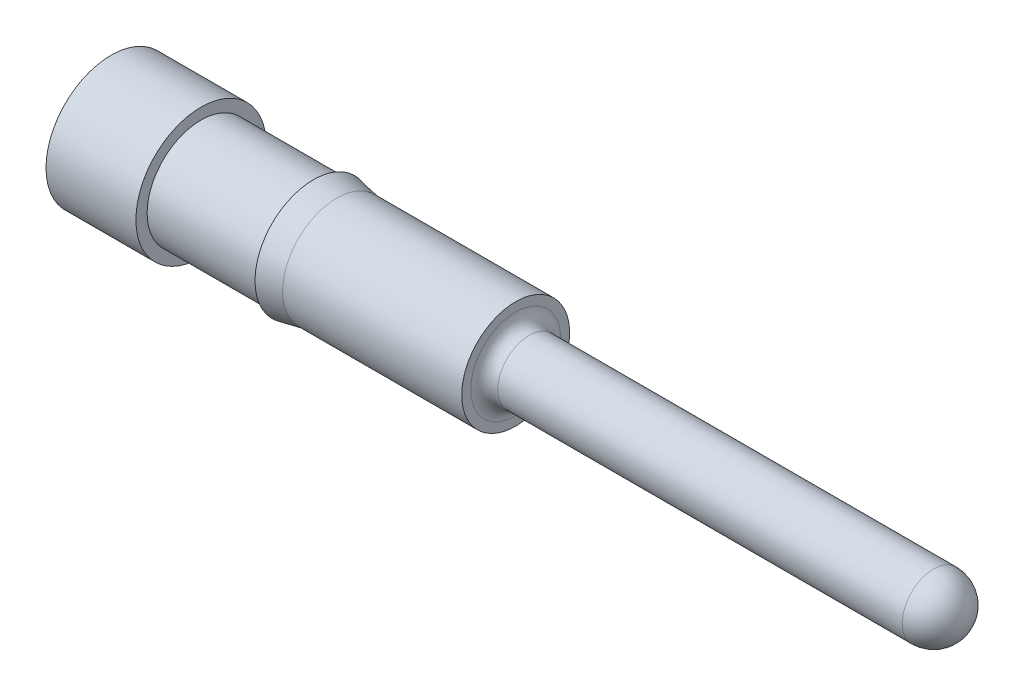
ISO-10303-21;
HEADER;
FILE_DESCRIPTION(('STEP AP214'),'2;1');
FILE_NAME('part.step','',(''),(''),'','','');
FILE_SCHEMA(('AUTOMOTIVE_DESIGN { 1 0 10303 214 1 1 1 1 }'));
ENDSEC;
DATA;
#1=APPLICATION_CONTEXT('core data for automotive mechanical design processes');
#2=APPLICATION_PROTOCOL_DEFINITION('international standard','automotive_design',2000,#1);
#3=PRODUCT_CONTEXT('',#1,'mechanical');
#4=PRODUCT('Part','Part','',(#3));
#5=PRODUCT_RELATED_PRODUCT_CATEGORY('part','',(#4));
#6=PRODUCT_DEFINITION_FORMATION('','',#4);
#7=PRODUCT_DEFINITION_CONTEXT('part definition',#1,'design');
#8=PRODUCT_DEFINITION('design','',#6,#7);
#9=PRODUCT_DEFINITION_SHAPE('','',#8);
#10=(LENGTH_UNIT() NAMED_UNIT(*) SI_UNIT(.MILLI.,.METRE.));
#11=(NAMED_UNIT(*) PLANE_ANGLE_UNIT() SI_UNIT($,.RADIAN.));
#12=(NAMED_UNIT(*) SI_UNIT($,.STERADIAN.) SOLID_ANGLE_UNIT());
#13=UNCERTAINTY_MEASURE_WITH_UNIT(LENGTH_MEASURE(1.E-05),#10,'distance_accuracy_value','');
#14=(GEOMETRIC_REPRESENTATION_CONTEXT(3) GLOBAL_UNCERTAINTY_ASSIGNED_CONTEXT((#13)) GLOBAL_UNIT_ASSIGNED_CONTEXT((#10,
#11,#12)) REPRESENTATION_CONTEXT('',''));
#15=CARTESIAN_POINT('',(0.,0.,0.));
#16=DIRECTION('',(0.,0.,1.));
#17=DIRECTION('',(1.,0.,0.));
#18=AXIS2_PLACEMENT_3D('',#15,#16,#17);
#19=CARTESIAN_POINT('',(0.,0.,0.));
#20=DIRECTION('',(1.,0.,0.));
#21=DIRECTION('',(0.,0.,-1.));
#22=AXIS2_PLACEMENT_3D('',#19,#20,#21);
#23=PLANE('',#22);
#24=CARTESIAN_POINT('',(0.,0.,0.));
#25=DIRECTION('',(-1.,0.,0.));
#26=DIRECTION('',(0.,0.,1.));
#27=AXIS2_PLACEMENT_3D('',#24,#25,#26);
#28=CIRCLE('',#27,0.3175);
#29=CARTESIAN_POINT('',(0.,0.,0.3175));
#30=VERTEX_POINT('',#29);
#31=EDGE_CURVE('E42',#30,#30,#28,.T.);
#32=ORIENTED_EDGE('',*,*,#31,.F.);
#33=EDGE_LOOP('',(#32));
#34=FACE_BOUND('',#33,.T.);
#35=CARTESIAN_POINT('',(0.,0.,0.));
#36=DIRECTION('',(-1.,0.,0.));
#37=DIRECTION('',(0.,0.,1.));
#38=AXIS2_PLACEMENT_3D('',#35,#36,#37);
#39=CIRCLE('',#38,0.3683);
#40=CARTESIAN_POINT('',(0.,0.,0.3683));
#41=VERTEX_POINT('',#40);
#42=EDGE_CURVE('E11',#41,#41,#39,.T.);
#43=ORIENTED_EDGE('',*,*,#42,.T.);
#44=EDGE_LOOP('',(#43));
#45=FACE_BOUND('',#44,.T.);
#46=ADVANCED_FACE('F16',(#34,#45),#23,.F.);
#47=CARTESIAN_POINT('',(0.,0.,0.));
#48=DIRECTION('',(-1.,0.,0.));
#49=DIRECTION('',(0.,0.,1.));
#50=AXIS2_PLACEMENT_3D('',#47,#48,#49);
#51=CYLINDRICAL_SURFACE('',#50,0.3683);
#52=ORIENTED_EDGE('',*,*,#42,.F.);
#53=EDGE_LOOP('',(#52));
#54=FACE_BOUND('',#53,.T.);
#55=CARTESIAN_POINT('',(0.508,0.,0.));
#56=DIRECTION('',(-1.,0.,0.));
#57=DIRECTION('',(0.,0.,1.));
#58=AXIS2_PLACEMENT_3D('',#55,#56,#57);
#59=CIRCLE('',#58,0.3683);
#60=CARTESIAN_POINT('',(0.508,0.,0.3683));
#61=VERTEX_POINT('',#60);
#62=EDGE_CURVE('E22',#61,#61,#59,.T.);
#63=ORIENTED_EDGE('',*,*,#62,.T.);
#64=EDGE_LOOP('',(#63));
#65=FACE_BOUND('',#64,.T.);
#66=ADVANCED_FACE('F68',(#54,#65),#51,.T.);
#67=CARTESIAN_POINT('',(0.508,0.3683,0.));
#68=DIRECTION('',(-1.,0.,0.));
#69=DIRECTION('',(0.,0.,1.));
#70=AXIS2_PLACEMENT_3D('',#67,#68,#69);
#71=PLANE('',#70);
#72=ORIENTED_EDGE('',*,*,#62,.F.);
#73=EDGE_LOOP('',(#72));
#74=FACE_BOUND('',#73,.T.);
#75=CARTESIAN_POINT('',(0.508,0.,0.));
#76=DIRECTION('',(-1.,0.,0.));
#77=DIRECTION('',(0.,0.,1.));
#78=AXIS2_PLACEMENT_3D('',#75,#76,#77);
#79=CIRCLE('',#78,0.304800000000022);
#80=CARTESIAN_POINT('',(0.508,0.,0.304800000000022));
#81=VERTEX_POINT('',#80);
#82=EDGE_CURVE('E63',#81,#81,#79,.T.);
#83=ORIENTED_EDGE('',*,*,#82,.T.);
#84=EDGE_LOOP('',(#83));
#85=FACE_BOUND('',#84,.T.);
#86=ADVANCED_FACE('F70',(#74,#85),#71,.F.);
#87=CARTESIAN_POINT('',(0.,0.,0.));
#88=DIRECTION('',(-1.,0.,0.));
#89=DIRECTION('',(0.,0.,1.));
#90=AXIS2_PLACEMENT_3D('',#87,#88,#89);
#91=CYLINDRICAL_SURFACE('',#90,0.304800000000022);
#92=ORIENTED_EDGE('',*,*,#82,.F.);
#93=EDGE_LOOP('',(#92));
#94=FACE_BOUND('',#93,.T.);
#95=CARTESIAN_POINT('',(1.143,0.,0.));
#96=DIRECTION('',(-1.,0.,0.));
#97=DIRECTION('',(0.,0.,1.));
#98=AXIS2_PLACEMENT_3D('',#95,#96,#97);
#99=CIRCLE('',#98,0.304800000000022);
#100=CARTESIAN_POINT('',(1.143,0.,0.304800000000022));
#101=VERTEX_POINT('',#100);
#102=EDGE_CURVE('E60',#101,#101,#99,.T.);
#103=ORIENTED_EDGE('',*,*,#102,.T.);
#104=EDGE_LOOP('',(#103));
#105=FACE_BOUND('',#104,.T.);
#106=ADVANCED_FACE('F73',(#94,#105),#91,.T.);
#107=CARTESIAN_POINT('',(1.143,0.304800000000022,0.));
#108=DIRECTION('',(1.,0.,0.));
#109=DIRECTION('',(0.,0.,-1.));
#110=AXIS2_PLACEMENT_3D('',#107,#108,#109);
#111=PLANE('',#110);
#112=ORIENTED_EDGE('',*,*,#102,.F.);
#113=EDGE_LOOP('',(#112));
#114=FACE_BOUND('',#113,.T.);
#115=CARTESIAN_POINT('',(1.143,0.,0.));
#116=DIRECTION('',(-1.,0.,0.));
#117=DIRECTION('',(0.,0.,1.));
#118=AXIS2_PLACEMENT_3D('',#115,#116,#117);
#119=CIRCLE('',#118,0.3302);
#120=CARTESIAN_POINT('',(1.143,0.,0.3302));
#121=VERTEX_POINT('',#120);
#122=EDGE_CURVE('E57',#121,#121,#119,.T.);
#123=ORIENTED_EDGE('',*,*,#122,.T.);
#124=EDGE_LOOP('',(#123));
#125=FACE_BOUND('',#124,.T.);
#126=ADVANCED_FACE('F79',(#114,#125),#111,.F.);
#127=CARTESIAN_POINT('',(1.27367167200553,0.,0.));
#128=DIRECTION('',(-1.,0.,0.));
#129=DIRECTION('',(0.,0.,1.));
#130=AXIS2_PLACEMENT_3D('',#127,#128,#129);
#131=CONICAL_SURFACE('',#130,0.304800000000022,0.191986217719377);
#132=ORIENTED_EDGE('',*,*,#122,.F.);
#133=EDGE_LOOP('',(#132));
#134=FACE_BOUND('',#133,.T.);
#135=CARTESIAN_POINT('',(1.27367167200553,0.,0.));
#136=DIRECTION('',(-1.,0.,0.));
#137=DIRECTION('',(0.,0.,1.));
#138=AXIS2_PLACEMENT_3D('',#135,#136,#137);
#139=CIRCLE('',#138,0.304800000000022);
#140=CARTESIAN_POINT('',(1.27367167200553,0.,0.304800000000022));
#141=VERTEX_POINT('',#140);
#142=EDGE_CURVE('E54',#141,#141,#139,.T.);
#143=ORIENTED_EDGE('',*,*,#142,.T.);
#144=EDGE_LOOP('',(#143));
#145=FACE_BOUND('',#144,.T.);
#146=ADVANCED_FACE('F85',(#134,#145),#131,.T.);
#147=CARTESIAN_POINT('',(0.,0.,0.));
#148=DIRECTION('',(-1.,0.,0.));
#149=DIRECTION('',(0.,0.,1.));
#150=AXIS2_PLACEMENT_3D('',#147,#148,#149);
#151=CYLINDRICAL_SURFACE('',#150,0.304800000000022);
#152=ORIENTED_EDGE('',*,*,#142,.F.);
#153=EDGE_LOOP('',(#152));
#154=FACE_BOUND('',#153,.T.);
#155=CARTESIAN_POINT('',(2.286,0.,0.));
#156=DIRECTION('',(-1.,0.,0.));
#157=DIRECTION('',(0.,0.,1.));
#158=AXIS2_PLACEMENT_3D('',#155,#156,#157);
#159=CIRCLE('',#158,0.304800000000022);
#160=CARTESIAN_POINT('',(2.286,0.,0.304800000000022));
#161=VERTEX_POINT('',#160);
#162=EDGE_CURVE('E51',#161,#161,#159,.T.);
#163=ORIENTED_EDGE('',*,*,#162,.T.);
#164=EDGE_LOOP('',(#163));
#165=FACE_BOUND('',#164,.T.);
#166=ADVANCED_FACE('F91',(#154,#165),#151,.T.);
#167=CARTESIAN_POINT('',(2.286,0.304800000000022,0.));
#168=DIRECTION('',(-1.,0.,0.));
#169=DIRECTION('',(0.,0.,1.));
#170=AXIS2_PLACEMENT_3D('',#167,#168,#169);
#171=PLANE('',#170);
#172=ORIENTED_EDGE('',*,*,#162,.F.);
#173=EDGE_LOOP('',(#172));
#174=FACE_BOUND('',#173,.T.);
#175=CARTESIAN_POINT('',(2.286,0.,0.));
#176=DIRECTION('',(-1.,0.,0.));
#177=DIRECTION('',(0.,0.,1.));
#178=AXIS2_PLACEMENT_3D('',#175,#176,#177);
#179=CIRCLE('',#178,0.254);
#180=CARTESIAN_POINT('',(2.286,0.,0.254));
#181=VERTEX_POINT('',#180);
#182=EDGE_CURVE('E48',#181,#181,#179,.T.);
#183=ORIENTED_EDGE('',*,*,#182,.T.);
#184=EDGE_LOOP('',(#183));
#185=FACE_BOUND('',#184,.T.);
#186=ADVANCED_FACE('F97',(#174,#185),#171,.F.);
#187=CARTESIAN_POINT('',(2.3622,0.,0.));
#188=DIRECTION('',(-1.,0.,0.));
#189=DIRECTION('',(0.,0.,1.));
#190=AXIS2_PLACEMENT_3D('',#187,#188,#189);
#191=TOROIDAL_SURFACE('',#190,0.254,0.0762000000000001);
#192=ORIENTED_EDGE('',*,*,#182,.F.);
#193=EDGE_LOOP('',(#192));
#194=FACE_BOUND('',#193,.T.);
#195=CARTESIAN_POINT('',(2.3622,0.,0.));
#196=DIRECTION('',(-1.,0.,0.));
#197=DIRECTION('',(0.,0.,1.));
#198=AXIS2_PLACEMENT_3D('',#195,#196,#197);
#199=CIRCLE('',#198,0.1778);
#200=CARTESIAN_POINT('',(2.3622,0.,0.1778));
#201=VERTEX_POINT('',#200);
#202=EDGE_CURVE('E39',#201,#201,#199,.T.);
#203=ORIENTED_EDGE('',*,*,#202,.T.);
#204=EDGE_LOOP('',(#203));
#205=FACE_BOUND('',#204,.T.);
#206=ADVANCED_FACE('F103',(#194,#205),#191,.F.);
#207=CARTESIAN_POINT('',(0.,0.,0.));
#208=DIRECTION('',(-1.,0.,0.));
#209=DIRECTION('',(0.,0.,1.));
#210=AXIS2_PLACEMENT_3D('',#207,#208,#209);
#211=CYLINDRICAL_SURFACE('',#210,0.1778);
#212=ORIENTED_EDGE('',*,*,#202,.F.);
#213=EDGE_LOOP('',(#212));
#214=FACE_BOUND('',#213,.T.);
#215=CARTESIAN_POINT('',(4.6482,0.,0.));
#216=DIRECTION('',(-1.,0.,0.));
#217=DIRECTION('',(0.,0.,1.));
#218=AXIS2_PLACEMENT_3D('',#215,#216,#217);
#219=CIRCLE('',#218,0.1778);
#220=CARTESIAN_POINT('',(4.6482,0.,0.1778));
#221=VERTEX_POINT('',#220);
#222=EDGE_CURVE('E35',#221,#221,#219,.T.);
#223=ORIENTED_EDGE('',*,*,#222,.T.);
#224=EDGE_LOOP('',(#223));
#225=FACE_BOUND('',#224,.T.);
#226=ADVANCED_FACE('F109',(#214,#225),#211,.T.);
#227=CARTESIAN_POINT('',(4.6482,0.,0.));
#228=DIRECTION('',(-1.,0.,0.));
#229=DIRECTION('',(0.,1.,0.));
#230=AXIS2_PLACEMENT_3D('',#227,#228,#229);
#231=SPHERICAL_SURFACE('',#230,0.1778);
#232=ORIENTED_EDGE('',*,*,#222,.F.);
#233=EDGE_LOOP('',(#232));
#234=FACE_BOUND('',#233,.T.);
#235=ADVANCED_FACE('F29',(#234),#231,.T.);
#236=CARTESIAN_POINT('',(1.905,0.,0.));
#237=DIRECTION('',(-1.,0.,0.));
#238=DIRECTION('',(0.,0.,1.));
#239=AXIS2_PLACEMENT_3D('',#236,#237,#238);
#240=CONICAL_SURFACE('',#239,0.26035,1.02974425867666);
#241=CARTESIAN_POINT('',(2.06143406216382,0.,0.));
#242=VERTEX_POINT('',#241);
#243=VERTEX_LOOP('',#242);
#244=FACE_BOUND('',#243,.T.);
#245=CARTESIAN_POINT('',(1.905,0.,0.));
#246=DIRECTION('',(-1.,0.,0.));
#247=DIRECTION('',(0.,0.,1.));
#248=AXIS2_PLACEMENT_3D('',#245,#246,#247);
#249=CIRCLE('',#248,0.26035);
#250=CARTESIAN_POINT('',(1.905,0.,0.26035));
#251=VERTEX_POINT('',#250);
#252=EDGE_CURVE('E33',#251,#251,#249,.T.);
#253=ORIENTED_EDGE('',*,*,#252,.T.);
#254=EDGE_LOOP('',(#253));
#255=FACE_BOUND('',#254,.T.);
#256=ADVANCED_FACE('F25',(#244,#255),#240,.F.);
#257=CARTESIAN_POINT('',(0.,0.,0.));
#258=DIRECTION('',(-1.,0.,0.));
#259=DIRECTION('',(0.,0.,1.));
#260=AXIS2_PLACEMENT_3D('',#257,#258,#259);
#261=CYLINDRICAL_SURFACE('',#260,0.26035);
#262=ORIENTED_EDGE('',*,*,#252,.F.);
#263=EDGE_LOOP('',(#262));
#264=FACE_BOUND('',#263,.T.);
#265=CARTESIAN_POINT('',(0.0571499999999995,0.,0.));
#266=DIRECTION('',(-1.,0.,0.));
#267=DIRECTION('',(0.,0.,1.));
#268=AXIS2_PLACEMENT_3D('',#265,#266,#267);
#269=CIRCLE('',#268,0.26035);
#270=CARTESIAN_POINT('',(0.0571499999999995,0.,0.26035));
#271=VERTEX_POINT('',#270);
#272=EDGE_CURVE('E36',#271,#271,#269,.T.);
#273=ORIENTED_EDGE('',*,*,#272,.T.);
#274=EDGE_LOOP('',(#273));
#275=FACE_BOUND('',#274,.T.);
#276=ADVANCED_FACE('F28',(#264,#275),#261,.F.);
#277=CARTESIAN_POINT('',(0.,0.,0.));
#278=DIRECTION('',(-1.,0.,0.));
#279=DIRECTION('',(0.,0.,1.));
#280=AXIS2_PLACEMENT_3D('',#277,#278,#279);
#281=CONICAL_SURFACE('',#280,0.3175,0.785398163397451);
#282=ORIENTED_EDGE('',*,*,#272,.F.);
#283=EDGE_LOOP('',(#282));
#284=FACE_BOUND('',#283,.T.);
#285=ORIENTED_EDGE('',*,*,#31,.T.);
#286=EDGE_LOOP('',(#285));
#287=FACE_BOUND('',#286,.T.);
#288=ADVANCED_FACE('F134',(#284,#287),#281,.F.);
#289=CLOSED_SHELL('',(#46,#66,#86,#106,#126,#146,#166,#186,#206,#226,#235,#256,#276,#288));
#290=MANIFOLD_SOLID_BREP('B1',#289);
#291=ADVANCED_BREP_SHAPE_REPRESENTATION('',(#18,#290),#14);
#292=SHAPE_DEFINITION_REPRESENTATION(#9,#291);
ENDSEC;
END-ISO-10303-21;
